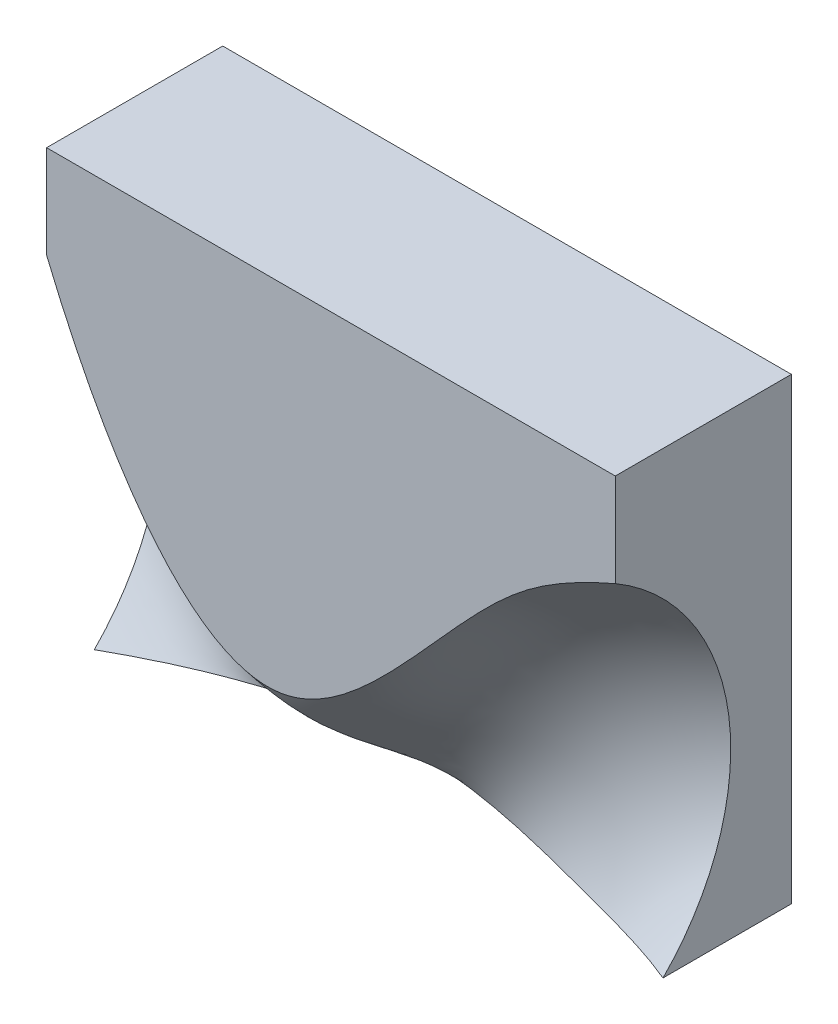
ISO-10303-21;
HEADER;
FILE_DESCRIPTION(('STEP AP214'),'2;1');
FILE_NAME('part.step','',(''),(''),'','','');
FILE_SCHEMA(('AUTOMOTIVE_DESIGN { 1 0 10303 214 1 1 1 1 }'));
ENDSEC;
DATA;
#1=APPLICATION_CONTEXT('core data for automotive mechanical design processes');
#2=APPLICATION_PROTOCOL_DEFINITION('international standard','automotive_design',2000,#1);
#3=PRODUCT_CONTEXT('',#1,'mechanical');
#4=PRODUCT('Part','Part','',(#3));
#5=PRODUCT_RELATED_PRODUCT_CATEGORY('part','',(#4));
#6=PRODUCT_DEFINITION_FORMATION('','',#4);
#7=PRODUCT_DEFINITION_CONTEXT('part definition',#1,'design');
#8=PRODUCT_DEFINITION('design','',#6,#7);
#9=PRODUCT_DEFINITION_SHAPE('','',#8);
#10=(LENGTH_UNIT() NAMED_UNIT(*) SI_UNIT(.MILLI.,.METRE.));
#11=(NAMED_UNIT(*) PLANE_ANGLE_UNIT() SI_UNIT($,.RADIAN.));
#12=(NAMED_UNIT(*) SI_UNIT($,.STERADIAN.) SOLID_ANGLE_UNIT());
#13=UNCERTAINTY_MEASURE_WITH_UNIT(LENGTH_MEASURE(1.E-05),#10,'distance_accuracy_value','');
#14=(GEOMETRIC_REPRESENTATION_CONTEXT(3) GLOBAL_UNCERTAINTY_ASSIGNED_CONTEXT((#13)) GLOBAL_UNIT_ASSIGNED_CONTEXT((#10,
#11,#12)) REPRESENTATION_CONTEXT('',''));
#15=CARTESIAN_POINT('',(0.,0.,0.));
#16=DIRECTION('',(0.,0.,1.));
#17=DIRECTION('',(1.,0.,0.));
#18=AXIS2_PLACEMENT_3D('',#15,#16,#17);
#19=CARTESIAN_POINT('',(155.,44.7708039134645,32.0313792476103));
#20=DIRECTION('',(1.,0.,0.));
#21=DIRECTION('',(0.,0.,-1.));
#22=AXIS2_PLACEMENT_3D('',#19,#20,#21);
#23=PLANE('',#22);
#24=DIRECTION('',(0.,1.,0.));
#25=VECTOR('',#24,1.);
#26=CARTESIAN_POINT('',(155.,0.,-48.));
#27=LINE('',#26,#25);
#28=CARTESIAN_POINT('',(155.,0.,-48.));
#29=VERTEX_POINT('',#28);
#30=CARTESIAN_POINT('',(155.,125.,-48.));
#31=VERTEX_POINT('',#30);
#32=EDGE_CURVE('E155',#29,#31,#27,.T.);
#33=ORIENTED_EDGE('',*,*,#32,.T.);
#34=DIRECTION('',(0.,0.,1.));
#35=VECTOR('',#34,1.);
#36=CARTESIAN_POINT('',(155.,125.,-48.));
#37=LINE('',#36,#35);
#38=CARTESIAN_POINT('',(155.,125.,0.));
#39=VERTEX_POINT('',#38);
#40=EDGE_CURVE('E242',#31,#39,#37,.T.);
#41=ORIENTED_EDGE('',*,*,#40,.T.);
#42=DIRECTION('',(0.,-1.,0.));
#43=VECTOR('',#42,1.);
#44=CARTESIAN_POINT('',(155.,125.,0.));
#45=LINE('',#44,#43);
#46=CARTESIAN_POINT('',(155.,99.6,0.));
#47=VERTEX_POINT('',#46);
#48=EDGE_CURVE('E240',#39,#47,#45,.T.);
#49=ORIENTED_EDGE('',*,*,#48,.T.);
#50=CARTESIAN_POINT('',(155.,44.7708039134645,32.0313792476103));
#51=DIRECTION('',(-1.,0.,0.));
#52=DIRECTION('',(0.,0.,-1.));
#53=AXIS2_PLACEMENT_3D('',#50,#51,#52);
#54=CIRCLE('',#53,63.5);
#55=CARTESIAN_POINT('',(155.,0.,-13.));
#56=VERTEX_POINT('',#55);
#57=EDGE_CURVE('E107',#47,#56,#54,.T.);
#58=ORIENTED_EDGE('',*,*,#57,.T.);
#59=DIRECTION('',(0.,0.,-1.));
#60=VECTOR('',#59,1.);
#61=CARTESIAN_POINT('',(155.,0.,-13.));
#62=LINE('',#61,#60);
#63=EDGE_CURVE('E13',#56,#29,#62,.T.);
#64=ORIENTED_EDGE('',*,*,#63,.T.);
#65=EDGE_LOOP('',(#33,#41,#49,#58,#64));
#66=FACE_BOUND('',#65,.T.);
#67=ADVANCED_FACE('F97',(#66),#23,.T.);
#68=CARTESIAN_POINT('',(0.,44.7708039134645,32.0313792476103));
#69=DIRECTION('',(1.,0.,0.));
#70=DIRECTION('',(0.,0.,-1.));
#71=AXIS2_PLACEMENT_3D('',#68,#69,#70);
#72=PLANE('',#71);
#73=CARTESIAN_POINT('',(0.,44.7708039134645,32.0313792476103));
#74=DIRECTION('',(-1.,0.,0.));
#75=DIRECTION('',(0.,0.,-1.));
#76=AXIS2_PLACEMENT_3D('',#73,#74,#75);
#77=CIRCLE('',#76,63.5);
#78=CARTESIAN_POINT('',(0.,99.6,0.));
#79=VERTEX_POINT('',#78);
#80=CARTESIAN_POINT('',(0.,0.,-13.));
#81=VERTEX_POINT('',#80);
#82=EDGE_CURVE('E223',#79,#81,#77,.T.);
#83=ORIENTED_EDGE('',*,*,#82,.F.);
#84=DIRECTION('',(0.,-1.,0.));
#85=VECTOR('',#84,1.);
#86=CARTESIAN_POINT('',(0.,99.6,0.));
#87=LINE('',#86,#85);
#88=CARTESIAN_POINT('',(0.,125.,0.));
#89=VERTEX_POINT('',#88);
#90=EDGE_CURVE('E216',#89,#79,#87,.T.);
#91=ORIENTED_EDGE('',*,*,#90,.F.);
#92=DIRECTION('',(0.,0.,1.));
#93=VECTOR('',#92,1.);
#94=CARTESIAN_POINT('',(0.,125.,0.));
#95=LINE('',#94,#93);
#96=CARTESIAN_POINT('',(0.,125.,-48.));
#97=VERTEX_POINT('',#96);
#98=EDGE_CURVE('E173',#97,#89,#95,.T.);
#99=ORIENTED_EDGE('',*,*,#98,.F.);
#100=DIRECTION('',(0.,1.,0.));
#101=VECTOR('',#100,1.);
#102=CARTESIAN_POINT('',(0.,125.,-48.));
#103=LINE('',#102,#101);
#104=CARTESIAN_POINT('',(0.,0.,-48.));
#105=VERTEX_POINT('',#104);
#106=EDGE_CURVE('E152',#105,#97,#103,.T.);
#107=ORIENTED_EDGE('',*,*,#106,.F.);
#108=DIRECTION('',(0.,0.,-1.));
#109=VECTOR('',#108,1.);
#110=CARTESIAN_POINT('',(0.,0.,-48.));
#111=LINE('',#110,#109);
#112=EDGE_CURVE('E160',#81,#105,#111,.T.);
#113=ORIENTED_EDGE('',*,*,#112,.F.);
#114=EDGE_LOOP('',(#83,#91,#99,#107,#113));
#115=FACE_BOUND('',#114,.T.);
#116=ADVANCED_FACE('F171',(#115),#72,.F.);
#117=CARTESIAN_POINT('',(0.,99.6,0.));
#118=CARTESIAN_POINT('',(18.4463147225643,55.0797553190255,0.));
#119=CARTESIAN_POINT('',(63.1479371753812,-4.12809199431208,0.));
#120=CARTESIAN_POINT('',(115.404515337188,79.9425296539021,0.));
#121=CARTESIAN_POINT('',(144.829157223597,95.1057896840998,0.));
#122=CARTESIAN_POINT('',(155.,99.6,0.));
#123=CARTESIAN_POINT('',(0.,98.3609811489257,-2.12087050686501));
#124=CARTESIAN_POINT('',(18.4664976210414,54.2167543326367,-1.21504740185438));
#125=CARTESIAN_POINT('',(63.1524036354619,-4.5646470743876,0.061651741691806));
#126=CARTESIAN_POINT('',(115.370254146534,78.5499694899022,-1.2592659578016));
#127=CARTESIAN_POINT('',(144.860938493674,93.8348090443819,-1.84494879154669));
#128=CARTESIAN_POINT('',(155.,98.3609811489257,-2.12087050686501));
#129=CARTESIAN_POINT('',(0.,95.6549508307603,-6.18938177909692));
#130=CARTESIAN_POINT('',(18.5068634179955,52.2627597438423,-3.47191246406506));
#131=CARTESIAN_POINT('',(63.1613365556236,-5.31133239023717,0.0341428339777198));
#132=CARTESIAN_POINT('',(115.301731765228,75.7821948276059,-3.69035702983969));
#133=CARTESIAN_POINT('',(144.924501033829,91.0648551489292,-5.36161663314196));
#134=CARTESIAN_POINT('',(155.,95.6549508307603,-6.18938177909692));
#135=CARTESIAN_POINT('',(0.,90.9695538174774,-11.7335083937412));
#136=CARTESIAN_POINT('',(18.6301534181345,49.1952116069509,-6.76764000527566));
#137=CARTESIAN_POINT('',(63.138642272238,-6.20752344616407,-0.290225843180809));
#138=CARTESIAN_POINT('',(115.220142305649,71.4657684309776,-7.01367686660776));
#139=CARTESIAN_POINT('',(145.003791524391,86.4942515737353,-10.1802253611247));
#140=CARTESIAN_POINT('',(155.,90.9695538174774,-11.7335083937412));
#141=CARTESIAN_POINT('',(0.,85.7189688801534,-16.6795819496924));
#142=CARTESIAN_POINT('',(18.7966518320037,45.881858824287,-9.83112760159955));
#143=CARTESIAN_POINT('',(63.0910755972589,-6.85627179130396,-0.945921663126462));
#144=CARTESIAN_POINT('',(115.153188478117,67.053712970156,-10.0452636347243));
#145=CARTESIAN_POINT('',(145.071990723106,81.4876326724401,-14.4950129618949));
#146=CARTESIAN_POINT('',(155.,85.7189688801534,-16.6795819496924));
#147=CARTESIAN_POINT('',(0.,79.9580691406499,-20.98901072987));
#148=CARTESIAN_POINT('',(19.0075391985815,42.3875103792098,-12.6745608491567));
#149=CARTESIAN_POINT('',(63.0176261729074,-7.28181699190851,-1.92259579200262));
#150=CARTESIAN_POINT('',(115.102115372988,62.5403645771865,-12.7910444215339));
#151=CARTESIAN_POINT('',(145.12803542904,76.1002733878092,-18.2890507047545));
#152=CARTESIAN_POINT('',(155.,79.9580691406499,-20.98901072987));
#153=CARTESIAN_POINT('',(0.,73.7533681616479,-24.6216836825481));
#154=CARTESIAN_POINT('',(19.2550233746642,38.7362381354707,-15.2692545123362));
#155=CARTESIAN_POINT('',(62.9225631817881,-7.49589507513657,-3.22539417412998));
#156=CARTESIAN_POINT('',(115.064836210733,57.9342297338487,-15.2636251088477));
#157=CARTESIAN_POINT('',(145.173428845595,70.3727511006798,-21.5374435931755));
#158=CARTESIAN_POINT('',(155.,73.7533681616479,-24.6216836825481));
#159=CARTESIAN_POINT('',(0.,67.1496650313612,-27.5403239745561));
#160=CARTESIAN_POINT('',(19.5340688073798,34.9534951781419,-17.5999064173275));
#161=CARTESIAN_POINT('',(62.8079256641425,-7.51279365984608,-4.85480286537044));
#162=CARTESIAN_POINT('',(115.041841743247,53.2487708356522,-17.4723672131441));
#163=CARTESIAN_POINT('',(145.207488176049,64.3412521960889,-24.2188561722644));
#164=CARTESIAN_POINT('',(155.,67.1496650313612,-27.5403239745561));
#165=CARTESIAN_POINT('',(0.,60.2327891732735,-29.7022994076778));
#166=CARTESIAN_POINT('',(19.8324197447298,31.0826303635871,-19.6468202602364));
#167=CARTESIAN_POINT('',(62.6807652748117,-7.34706192504421,-6.81260362830807));
#168=CARTESIAN_POINT('',(115.028988902285,48.4778589158644,-19.4282961477643));
#169=CARTESIAN_POINT('',(145.233351989731,58.0604410177421,-26.3102458475641));
#170=CARTESIAN_POINT('',(155.,60.2327891732735,-29.7022994076778));
#171=CARTESIAN_POINT('',(0.,53.0076507425958,-31.0755395355803));
#172=CARTESIAN_POINT('',(20.144850986043,27.1254636222994,-21.3968438091079));
#173=CARTESIAN_POINT('',(62.5425281387963,-7.01010327350659,-9.09937842527562));
#174=CARTESIAN_POINT('',(115.028498099343,43.6543418220271,-21.1380944441463));
#175=CARTESIAN_POINT('',(145.248772787193,51.5479361058217,-27.7927896505866));
#176=CARTESIAN_POINT('',(155.,53.0076507425958,-31.0755395355803));
#177=CARTESIAN_POINT('',(0.,45.672092232779,-31.6027919802322));
#178=CARTESIAN_POINT('',(20.4432788965397,23.1823753650142,-22.8256465984788));
#179=CARTESIAN_POINT('',(62.4120262264035,-6.51990884840113,-11.7175534306069));
#180=CARTESIAN_POINT('',(115.024096059769,38.7163201484997,-22.6163872774511));
#181=CARTESIAN_POINT('',(145.267039863834,44.911294616733,-28.6399852733103));
#182=CARTESIAN_POINT('',(155.,45.672092232779,-31.6027919802322));
#183=CARTESIAN_POINT('',(0.,38.4320232107829,-31.2886105575634));
#184=CARTESIAN_POINT('',(20.7029028493539,19.3539870186429,-23.9397479878446));
#185=CARTESIAN_POINT('',(62.3060552194046,-5.89476855310294,-14.6663648776522));
#186=CARTESIAN_POINT('',(115.000944667747,33.6023850006233,-23.8510255886163));
#187=CARTESIAN_POINT('',(145.300309173521,38.257644109683,-28.850889528224));
#188=CARTESIAN_POINT('',(155.,38.4320232107829,-31.2886105575634));
#189=CARTESIAN_POINT('',(0.,31.3004209053273,-30.1627310152004));
#190=CARTESIAN_POINT('',(20.9165327822861,15.6413046023886,-24.7558139049714));
#191=CARTESIAN_POINT('',(62.2278437023826,-5.14547909627311,-17.9436631896897));
#192=CARTESIAN_POINT('',(114.958934369273,28.344755482004,-24.8219143507208));
#193=CARTESIAN_POINT('',(145.348334521774,31.6051295779082,-28.4321920942408));
#194=CARTESIAN_POINT('',(155.,31.3004209053273,-30.1627310152004));
#195=CARTESIAN_POINT('',(0.,24.3711818134048,-28.2443273488879));
#196=CARTESIAN_POINT('',(21.0690663023176,12.0856539004604,-25.2848639086261));
#197=CARTESIAN_POINT('',(62.1862698685296,-4.28605351190423,-21.5477862763232));
#198=CARTESIAN_POINT('',(114.892477761032,22.9382230247758,-25.5141051724523));
#199=CARTESIAN_POINT('',(145.415416993732,25.0074905873629,-27.3856831894418));
#200=CARTESIAN_POINT('',(155.,24.3711818134048,-28.2443273488879));
#201=CARTESIAN_POINT('',(0.,17.6971720967382,-25.5579289194153));
#202=CARTESIAN_POINT('',(21.1495474548204,8.70922940144126,-25.5350669118764));
#203=CARTESIAN_POINT('',(62.1867360223851,-3.32897618144512,-25.4784255926592));
#204=CARTESIAN_POINT('',(114.800174546516,17.3953315976007,-25.9124184074712));
#205=CARTESIAN_POINT('',(145.502290700517,18.5015832999094,-25.7132243435808));
#206=CARTESIAN_POINT('',(155.,17.6971720967382,-25.5579289194153));
#207=CARTESIAN_POINT('',(0.,11.352972391517,-22.1252308690171));
#208=CARTESIAN_POINT('',(21.1424132918595,5.53851793405746,-25.524066254818));
#209=CARTESIAN_POINT('',(62.2361865945747,-2.28808233479409,-29.7306504130613));
#210=CARTESIAN_POINT('',(114.68189967969,11.7272174008486,-26.0027586346634));
#211=CARTESIAN_POINT('',(145.608321946345,12.1257357814289,-23.416156210243));
#212=CARTESIAN_POINT('',(155.,11.352972391517,-22.1252308690171));
#213=CARTESIAN_POINT('',(0.,5.40152289311241,-17.9694476745731));
#214=CARTESIAN_POINT('',(21.046921173731,2.621200461613,-25.2196232638645));
#215=CARTESIAN_POINT('',(62.3332067020537,-1.17578179273334,-34.3199640336552));
#216=CARTESIAN_POINT('',(114.542109072382,5.91738083540859,-25.7752904368487));
#217=CARTESIAN_POINT('',(145.729467596306,5.94414714939489,-20.4895965362154));
#218=CARTESIAN_POINT('',(155.,5.40152289311242,-17.9694476745731));
#219=CARTESIAN_POINT('',(0.,1.74187715572148,-14.7317977348937));
#220=CARTESIAN_POINT('',(20.8910489094842,0.815103011888346,-24.9182636910272));
#221=CARTESIAN_POINT('',(62.4431843425945,-0.397793523795577,-37.5667434371804));
#222=CARTESIAN_POINT('',(114.437566543697,2.01614240489604,-25.3930065527386));
#223=CARTESIAN_POINT('',(145.816017155376,1.92275190781566,-18.1323136424423));
#224=CARTESIAN_POINT('',(155.,1.74187715572148,-14.7317977348937));
#225=CARTESIAN_POINT('',(0.,0.,-13.));
#226=CARTESIAN_POINT('',(20.8131127773609,0.,-24.6546111395546));
#227=CARTESIAN_POINT('',(62.4981731628649,0.,-39.2734209963057));
#228=CARTESIAN_POINT('',(114.385295279354,0.,-25.14992518824));
#229=CARTESIAN_POINT('',(145.859291934911,0.,-16.8406994305017));
#230=CARTESIAN_POINT('',(155.,0.,-13.));
#231=B_SPLINE_SURFACE_WITH_KNOTS('',3,3,((#117,#118,#119,#120,#121,#122),(#123,#124,#125,#126,
#127,#128),(#129,#130,#131,#132,#133,#134),(#135,#136,#137,#138,#139,#140),(#141,#142,#143,#144,
#145,#146),(#147,#148,#149,#150,#151,#152),(#153,#154,#155,#156,#157,#158),(#159,#160,#161,#162,
#163,#164),(#165,#166,#167,#168,#169,#170),(#171,#172,#173,#174,#175,#176),(#177,#178,#179,#180,
#181,#182),(#183,#184,#185,#186,#187,#188),(#189,#190,#191,#192,#193,#194),(#195,#196,#197,#198,
#199,#200),(#201,#202,#203,#204,#205,#206),(#207,#208,#209,#210,#211,#212),(#213,#214,#215,#216,
#217,#218),(#219,#220,#221,#222,#223,#224),(#225,#226,#227,#228,#229,#230)),.UNSPECIFIED.,.F.,
.F.,.F.,(4,1,1,1,1,1,1,1,1,1,1,1,1,1,1,1,4),(4,1,1,4),(0.,0.0625,0.125,0.1875,0.25,0.3125,0.375,
0.4375,0.5,0.5625,0.625,0.6875,0.75,0.8125,0.875,0.9375,1.),(0.,0.419525087310185,
0.824952913607741,1.),.UNSPECIFIED.);
#232=CARTESIAN_POINT('',(0.,0.,-13.));
#233=CARTESIAN_POINT('',(20.8131127773609,0.,-24.6546111395546));
#234=CARTESIAN_POINT('',(62.4981731628649,0.,-39.2734209963057));
#235=CARTESIAN_POINT('',(114.385295279354,0.,-25.14992518824));
#236=CARTESIAN_POINT('',(145.859291934911,0.,-16.8406994305017));
#237=CARTESIAN_POINT('',(155.,0.,-13.));
#238=B_SPLINE_CURVE_WITH_KNOTS('',3,(#232,#233,#234,#235,#236,#237),.UNSPECIFIED.,.F.,.F.,(4,1,
1,4),(0.,0.419525087310185,0.824952913607741,1.),.UNSPECIFIED.);
#239=EDGE_CURVE('E122',#81,#56,#238,.T.);
#240=CARTESIAN_POINT('',(0.,99.6,0.));
#241=CARTESIAN_POINT('',(18.4463147225643,55.0797553190255,0.));
#242=CARTESIAN_POINT('',(63.1479371753812,-4.12809199431208,0.));
#243=CARTESIAN_POINT('',(115.404515337188,79.9425296539021,0.));
#244=CARTESIAN_POINT('',(144.829157223597,95.1057896840998,0.));
#245=CARTESIAN_POINT('',(155.,99.6,0.));
#246=B_SPLINE_CURVE_WITH_KNOTS('',3,(#240,#241,#242,#243,#244,#245),.UNSPECIFIED.,.F.,.F.,(4,1,
1,4),(0.,0.419525087310185,0.824952913607741,1.),.UNSPECIFIED.);
#247=EDGE_CURVE('E166',#47,#79,#246,.F.);
#248=CARTESIAN_POINT('',(-5.80397601247188E-05,99.6001400791627,0.));
#249=CARTESIAN_POINT('',(-3.86931734164792E-05,99.6000933861085,0.));
#250=CARTESIAN_POINT('',(-1.93465867082396E-05,99.6000466930542,0.));
#251=CARTESIAN_POINT('',(0.,99.6,0.));
#252=CARTESIAN_POINT('',(18.4463147225643,55.0797553190255,0.));
#253=CARTESIAN_POINT('',(63.1479371753812,-4.12809199431208,0.));
#254=CARTESIAN_POINT('',(115.404515337188,79.9425296539021,0.));
#255=CARTESIAN_POINT('',(144.829157223597,95.1057896840998,0.));
#256=CARTESIAN_POINT('',(155.,99.6,0.));
#257=CARTESIAN_POINT('',(-5.81032638979032E-05,98.3611200449802,-2.12087335696035));
#258=CARTESIAN_POINT('',(-3.87355092652688E-05,98.3610737462954,-2.12087240692857));
#259=CARTESIAN_POINT('',(-1.93677546326344E-05,98.3610274476106,-2.12087145689679));
#260=CARTESIAN_POINT('',(0.,98.3609811489257,-2.12087050686501));
#261=CARTESIAN_POINT('',(18.4664976210414,54.2167543326367,-1.21504740185438));
#262=CARTESIAN_POINT('',(63.1524036354619,-4.5646470743876,0.061651741691806));
#263=CARTESIAN_POINT('',(115.370254146534,78.5499694899022,-1.2592659578016));
#264=CARTESIAN_POINT('',(144.860938493674,93.8348090443819,-1.84494879154669));
#265=CARTESIAN_POINT('',(155.,98.3609811489257,-2.12087050686501));
#266=CARTESIAN_POINT('',(-5.82302714442722E-05,95.6550873605983,-6.18939032938295));
#267=CARTESIAN_POINT('',(-3.88201809628482E-05,95.6550418506523,-6.18938747928761));
#268=CARTESIAN_POINT('',(-1.94100904814241E-05,95.6549963407063,-6.18938462919226));
#269=CARTESIAN_POINT('',(0.,95.6549508307603,-6.18938177909692));
#270=CARTESIAN_POINT('',(18.5068634179955,52.2627597438423,-3.47191246406506));
#271=CARTESIAN_POINT('',(63.1613365556236,-5.31133239023717,0.0341428339777198));
#272=CARTESIAN_POINT('',(115.301731765228,75.7821948276059,-3.69035702983969));
#273=CARTESIAN_POINT('',(144.924501033829,91.0648551489292,-5.36161663314196));
#274=CARTESIAN_POINT('',(155.,95.6549508307603,-6.18938177909692));
#275=CARTESIAN_POINT('',(-5.86181929419515E-05,90.9696852568916,-11.7335240184236));
#276=CARTESIAN_POINT('',(-3.90787952946343E-05,90.9696414437535,-11.7335188101961));
#277=CARTESIAN_POINT('',(-1.95393976473172E-05,90.9695976306154,-11.7335136019686));
#278=CARTESIAN_POINT('',(0.,90.9695538174774,-11.7335083937412));
#279=CARTESIAN_POINT('',(18.6301534181345,49.1952116069509,-6.76764000527566));
#280=CARTESIAN_POINT('',(63.138642272238,-6.20752344616407,-0.290225843180809));
#281=CARTESIAN_POINT('',(115.220142305649,71.4657684309776,-7.01367686660776));
#282=CARTESIAN_POINT('',(145.003791524391,86.4942515737353,-10.1802253611247));
#283=CARTESIAN_POINT('',(155.,90.9695538174774,-11.7335083937412));
#284=CARTESIAN_POINT('',(-5.91420660378766E-05,85.7190942242315,-16.6796034977714));
#285=CARTESIAN_POINT('',(-3.94280440252511E-05,85.7190524428721,-16.6795963150784));
#286=CARTESIAN_POINT('',(-1.97140220126255E-05,85.7190106615128,-16.6795891323854));
#287=CARTESIAN_POINT('',(0.,85.7189688801534,-16.6795819496924));
#288=CARTESIAN_POINT('',(18.7966518320037,45.881858824287,-9.83112760159955));
#289=CARTESIAN_POINT('',(63.0910755972589,-6.85627179130396,-0.945921663126462));
#290=CARTESIAN_POINT('',(115.153188478117,67.053712970156,-10.0452636347243));
#291=CARTESIAN_POINT('',(145.071990723106,81.4876326724401,-14.4950129618949));
#292=CARTESIAN_POINT('',(155.,85.7189688801534,-16.6795819496924));
#293=CARTESIAN_POINT('',(-5.98056051975187E-05,79.9581873532171,-20.9890368905792));
#294=CARTESIAN_POINT('',(-3.98704034650125E-05,79.958147949028,-20.9890281703428));
#295=CARTESIAN_POINT('',(-1.99352017325062E-05,79.958108544839,-20.9890194501064));
#296=CARTESIAN_POINT('',(0.,79.9580691406499,-20.98901072987));
#297=CARTESIAN_POINT('',(19.0075391985815,42.3875103792098,-12.6745608491567));
#298=CARTESIAN_POINT('',(63.0176261729074,-7.28181699190851,-1.92259579200262));
#299=CARTESIAN_POINT('',(115.102115372988,62.5403645771865,-12.7910444215339));
#300=CARTESIAN_POINT('',(145.12803542904,76.1002733878092,-18.2890507047545));
#301=CARTESIAN_POINT('',(155.,79.9580691406499,-20.98901072987));
#302=CARTESIAN_POINT('',(-6.05842931051329E-05,73.7534783400687,-24.6217131091709));
#303=CARTESIAN_POINT('',(-4.03895287367552E-05,73.7534416139284,-24.6217033002966));
#304=CARTESIAN_POINT('',(-2.01947643683776E-05,73.7534048877882,-24.6216934914224));
#305=CARTESIAN_POINT('',(0.,73.7533681616479,-24.6216836825481));
#306=CARTESIAN_POINT('',(19.2550233746642,38.7362381354707,-15.2692545123362));
#307=CARTESIAN_POINT('',(62.9225631817881,-7.49589507513657,-3.22539417412998));
#308=CARTESIAN_POINT('',(115.064836210733,57.9342297338487,-15.2636251088477));
#309=CARTESIAN_POINT('',(145.173428845595,70.3727511006798,-21.5374435931755));
#310=CARTESIAN_POINT('',(155.,73.7533681616479,-24.6216836825481));
#311=CARTESIAN_POINT('',(-6.14622858219599E-05,67.1497663338708,-27.5403552512344));
#312=CARTESIAN_POINT('',(-4.097485721464E-05,67.1497325663676,-27.540344825675));
#313=CARTESIAN_POINT('',(-2.048742860732E-05,67.1496987988644,-27.5403344001156));
#314=CARTESIAN_POINT('',(0.,67.1496650313612,-27.5403239745561));
#315=CARTESIAN_POINT('',(19.5340688073798,34.9534951781419,-17.5999064173275));
#316=CARTESIAN_POINT('',(62.8079256641425,-7.51279365984608,-4.85480286537044));
#317=CARTESIAN_POINT('',(115.041841743247,53.2487708356522,-17.4723672131441));
#318=CARTESIAN_POINT('',(145.207488176049,64.3412521960889,-24.2188561722644));
#319=CARTESIAN_POINT('',(155.,67.1496650313612,-27.5403239745561));
#320=CARTESIAN_POINT('',(-6.24010216668818E-05,60.2328808917685,-29.7023310463875));
#321=CARTESIAN_POINT('',(-4.16006811112545E-05,60.2328503189368,-29.7023205001509));
#322=CARTESIAN_POINT('',(-2.08003405556273E-05,60.2328197461051,-29.7023099539144));
#323=CARTESIAN_POINT('',(0.,60.2327891732735,-29.7022994076778));
#324=CARTESIAN_POINT('',(19.8324197447298,31.0826303635871,-19.6468202602364));
#325=CARTESIAN_POINT('',(62.6807652748117,-7.34706192504421,-6.81260362830807));
#326=CARTESIAN_POINT('',(115.028988902285,48.4778589158644,-19.4282961477643));
#327=CARTESIAN_POINT('',(145.233351989731,58.0604410177421,-26.3102458475641));
#328=CARTESIAN_POINT('',(155.,60.2327891732735,-29.7022994076778));
#329=CARTESIAN_POINT('',(-6.33840599904718E-05,53.0077321786959,-31.0755699887731));
#330=CARTESIAN_POINT('',(-4.22560399936479E-05,53.0077050333292,-31.0755598377089));
#331=CARTESIAN_POINT('',(-2.11280199968239E-05,53.0076778879625,-31.0755496866446));
#332=CARTESIAN_POINT('',(0.,53.0076507425958,-31.0755395355803));
#333=CARTESIAN_POINT('',(20.144850986043,27.1254636222994,-21.3968438091079));
#334=CARTESIAN_POINT('',(62.5425281387963,-7.01010327350659,-9.09937842527562));
#335=CARTESIAN_POINT('',(115.028498099343,43.6543418220271,-21.1380944441463));
#336=CARTESIAN_POINT('',(145.248772787193,51.5479361058217,-27.7927896505866));
#337=CARTESIAN_POINT('',(155.,53.0076507425958,-31.0755395355803));
#338=CARTESIAN_POINT('',(-6.43230380248519E-05,45.67216299476,-31.6028195967735));
#339=CARTESIAN_POINT('',(-4.28820253499012E-05,45.672139407433,-31.6028103912598));
#340=CARTESIAN_POINT('',(-2.14410126749506E-05,45.672115820106,-31.602801185746));
#341=CARTESIAN_POINT('',(0.,45.672092232779,-31.6027919802322));
#342=CARTESIAN_POINT('',(20.4432788965397,23.1823753650142,-22.8256465984788));
#343=CARTESIAN_POINT('',(62.4120262264035,-6.51990884840113,-11.7175534306069));
#344=CARTESIAN_POINT('',(115.024096059769,38.7163201484997,-22.6163872774511));
#345=CARTESIAN_POINT('',(145.267039863834,44.911294616733,-28.6399852733103));
#346=CARTESIAN_POINT('',(155.,45.672092232779,-31.6027919802322));
#347=CARTESIAN_POINT('',(-6.51399227072724E-05,38.4320832382009,-31.2886336801343));
#348=CARTESIAN_POINT('',(-4.34266151381816E-05,38.4320632290616,-31.2886259726107));
#349=CARTESIAN_POINT('',(-2.17133075690908E-05,38.4320432199222,-31.288618265087));
#350=CARTESIAN_POINT('',(0.,38.4320232107829,-31.2886105575634));
#351=CARTESIAN_POINT('',(20.7029028493539,19.3539870186429,-23.9397479878446));
#352=CARTESIAN_POINT('',(62.3060552194046,-5.89476855310294,-14.6663648776522));
#353=CARTESIAN_POINT('',(115.000944667747,33.6023850006233,-23.8510255886163));
#354=CARTESIAN_POINT('',(145.300309173521,38.257644109683,-28.850889528224));
#355=CARTESIAN_POINT('',(155.,38.4320232107829,-31.2886105575634));
#356=CARTESIAN_POINT('',(-6.58120911186503E-05,31.3004701754047,-30.1627480276052));
#357=CARTESIAN_POINT('',(-4.38747274124335E-05,31.3004537520456,-30.1627423568036));
#358=CARTESIAN_POINT('',(-2.19373637062168E-05,31.3004373286864,-30.162736686002));
#359=CARTESIAN_POINT('',(0.,31.3004209053273,-30.1627310152004));
#360=CARTESIAN_POINT('',(20.9165327822861,15.6413046023886,-24.7558139049714));
#361=CARTESIAN_POINT('',(62.2278437023826,-5.14547909627311,-17.9436631896897));
#362=CARTESIAN_POINT('',(114.958934369273,28.344755482004,-24.8219143507208));
#363=CARTESIAN_POINT('',(145.348334521774,31.6051295779082,-28.4321920942408));
#364=CARTESIAN_POINT('',(155.,31.3004209053273,-30.1627310152004));
#365=CARTESIAN_POINT('',(-6.62920248640493E-05,24.3712204687733,-28.2443366605879));
#366=CARTESIAN_POINT('',(-4.41946832426995E-05,24.3712075836505,-28.2443335566879));
#367=CARTESIAN_POINT('',(-2.20973416213498E-05,24.3711946985277,-28.2443304527879));
#368=CARTESIAN_POINT('',(0.,24.3711818134048,-28.2443273488879));
#369=CARTESIAN_POINT('',(21.0690663023176,12.0856539004604,-25.2848639086261));
#370=CARTESIAN_POINT('',(62.1862698685296,-4.28605351190423,-21.5477862763232));
#371=CARTESIAN_POINT('',(114.892477761032,22.9382230247758,-25.5141051724523));
#372=CARTESIAN_POINT('',(145.415416993732,25.0074905873629,-27.3856831894418));
#373=CARTESIAN_POINT('',(155.,24.3711818134048,-28.2443273488879));
#374=CARTESIAN_POINT('',(-6.65452519642088E-05,17.6972003765354,-25.5579289913487));
#375=CARTESIAN_POINT('',(-4.43635013094725E-05,17.6971909499363,-25.5579289673709));
#376=CARTESIAN_POINT('',(-2.21817506547363E-05,17.6971815233373,-25.5579289433931));
#377=CARTESIAN_POINT('',(0.,17.6971720967382,-25.5579289194153));
#378=CARTESIAN_POINT('',(21.1495474548204,8.70922940144126,-25.5350669118764));
#379=CARTESIAN_POINT('',(62.1867360223851,-3.32897618144512,-25.4784255926592));
#380=CARTESIAN_POINT('',(114.800174546516,17.3953315976007,-25.9124184074712));
#381=CARTESIAN_POINT('',(145.502290700517,18.5015832999094,-25.7132243435808));
#382=CARTESIAN_POINT('',(155.,17.6971720967382,-25.5579289194153));
#383=CARTESIAN_POINT('',(-6.65228049273251E-05,11.3529906862033,-22.1252201748707));
#384=CARTESIAN_POINT('',(-4.43485366182167E-05,11.3529845879745,-22.1252237395862));
#385=CARTESIAN_POINT('',(-2.21742683091084E-05,11.3529784897458,-22.1252273043017));
#386=CARTESIAN_POINT('',(0.,11.352972391517,-22.1252308690171));
#387=CARTESIAN_POINT('',(21.1424132918595,5.53851793405746,-25.524066254818));
#388=CARTESIAN_POINT('',(62.2361865945747,-2.28808233479409,-29.7306504130613));
#389=CARTESIAN_POINT('',(114.68189967969,11.7272174008486,-26.0027586346634));
#390=CARTESIAN_POINT('',(145.608321946345,12.1257357814289,-23.416156210243));
#391=CARTESIAN_POINT('',(155.,11.352972391517,-22.1252308690171));
#392=CARTESIAN_POINT('',(-6.62223471007437E-05,5.40153164116044,-17.9694248625123));
#393=CARTESIAN_POINT('',(-4.41482314004958E-05,5.40152872514443,-17.9694324665326));
#394=CARTESIAN_POINT('',(-2.20741157002479E-05,5.40152580912842,-17.9694400705528));
#395=CARTESIAN_POINT('',(0.,5.40152289311241,-17.9694476745731));
#396=CARTESIAN_POINT('',(21.046921173731,2.621200461613,-25.2196232638645));
#397=CARTESIAN_POINT('',(62.3332067020537,-1.17578179273334,-34.3199640336552));
#398=CARTESIAN_POINT('',(114.542109072382,5.91738083540859,-25.7752904368487));
#399=CARTESIAN_POINT('',(145.729467596306,5.94414714939489,-20.4895965362154));
#400=CARTESIAN_POINT('',(155.,5.40152289311242,-17.9694476745731));
#401=CARTESIAN_POINT('',(-6.57319082806844E-05,1.74188007173749,-14.7317656840451));
#402=CARTESIAN_POINT('',(-4.38212721871229E-05,1.74187909973215,-14.7317763676613));
#403=CARTESIAN_POINT('',(-2.19106360935615E-05,1.74187812772682,-14.7317870512775));
#404=CARTESIAN_POINT('',(0.,1.74187715572148,-14.7317977348937));
#405=CARTESIAN_POINT('',(20.8910489094842,0.815103011888346,-24.9182636910272));
#406=CARTESIAN_POINT('',(62.4431843425945,-0.397793523795577,-37.5667434371804));
#407=CARTESIAN_POINT('',(114.437566543697,2.01614240489604,-25.3930065527386));
#408=CARTESIAN_POINT('',(145.816017155376,1.92275190781566,-18.1323136424423));
#409=CARTESIAN_POINT('',(155.,1.74187715572148,-14.7317977348937));
#410=CARTESIAN_POINT('',(-6.54866888706547E-05,0.,-12.9999633297575));
#411=CARTESIAN_POINT('',(-4.36577925804365E-05,0.,-12.9999755531717));
#412=CARTESIAN_POINT('',(-2.18288962902182E-05,0.,-12.9999877765858));
#413=CARTESIAN_POINT('',(0.,0.,-13.));
#414=CARTESIAN_POINT('',(20.8131127773609,0.,-24.6546111395546));
#415=CARTESIAN_POINT('',(62.4981731628649,0.,-39.2734209963057));
#416=CARTESIAN_POINT('',(114.385295279354,0.,-25.14992518824));
#417=CARTESIAN_POINT('',(145.859291934911,0.,-16.8406994305017));
#418=CARTESIAN_POINT('',(155.,0.,-13.));
#419=B_SPLINE_SURFACE_WITH_KNOTS('',3,3,((#248,#249,#250,#251,#252,#253,#254,#255,#256),(#257,
#258,#259,#260,#261,#262,#263,#264,#265),(#266,#267,#268,#269,#270,#271,#272,#273,#274),(#275,
#276,#277,#278,#279,#280,#281,#282,#283),(#284,#285,#286,#287,#288,#289,#290,#291,#292),(#293,
#294,#295,#296,#297,#298,#299,#300,#301),(#302,#303,#304,#305,#306,#307,#308,#309,#310),(#311,
#312,#313,#314,#315,#316,#317,#318,#319),(#320,#321,#322,#323,#324,#325,#326,#327,#328),(#329,
#330,#331,#332,#333,#334,#335,#336,#337),(#338,#339,#340,#341,#342,#343,#344,#345,#346),(#347,
#348,#349,#350,#351,#352,#353,#354,#355),(#356,#357,#358,#359,#360,#361,#362,#363,#364),(#365,
#366,#367,#368,#369,#370,#371,#372,#373),(#374,#375,#376,#377,#378,#379,#380,#381,#382),(#383,
#384,#385,#386,#387,#388,#389,#390,#391),(#392,#393,#394,#395,#396,#397,#398,#399,#400),(#401,
#402,#403,#404,#405,#406,#407,#408,#409),(#410,#411,#412,#413,#414,#415,#416,#417,#418)),
.UNSPECIFIED.,.F.,.F.,.F.,(4,1,1,1,1,1,1,1,1,1,1,1,1,1,1,1,4),(4,3,1,1,4),(0.,0.0625,0.125,
0.1875,0.25,0.3125,0.375,0.4375,0.5,0.5625,0.625,0.6875,0.75,0.8125,0.875,0.9375,1.),(-4.4E-07,
0.,0.419525087310185,0.824952913607741,1.),.UNSPECIFIED.);
#420=ORIENTED_EDGE('',*,*,#82,.T.);
#421=ORIENTED_EDGE('',*,*,#239,.T.);
#422=ORIENTED_EDGE('',*,*,#57,.F.);
#423=ORIENTED_EDGE('',*,*,#247,.T.);
#424=EDGE_LOOP('',(#420,#421,#422,#423));
#425=FACE_BOUND('',#424,.T.);
#426=ADVANCED_FACE('F192',(#425),#419,.T.);
#427=CARTESIAN_POINT('',(0.,0.,-13.));
#428=DIRECTION('',(0.,-1.,0.));
#429=DIRECTION('',(0.,0.,-1.));
#430=AXIS2_PLACEMENT_3D('',#427,#428,#429);
#431=PLANE('',#430);
#432=ORIENTED_EDGE('',*,*,#112,.T.);
#433=DIRECTION('',(1.,0.,0.));
#434=VECTOR('',#433,1.);
#435=CARTESIAN_POINT('',(75.8973132648566,0.,-48.));
#436=LINE('',#435,#434);
#437=EDGE_CURVE('E147',#105,#29,#436,.T.);
#438=ORIENTED_EDGE('',*,*,#437,.T.);
#439=ORIENTED_EDGE('',*,*,#63,.F.);
#440=ORIENTED_EDGE('',*,*,#239,.F.);
#441=EDGE_LOOP('',(#432,#438,#439,#440));
#442=FACE_BOUND('',#441,.T.);
#443=ADVANCED_FACE('F162',(#442),#431,.T.);
#444=CARTESIAN_POINT('',(0.,125.,0.));
#445=DIRECTION('',(0.,0.,1.));
#446=DIRECTION('',(0.,-1.,0.));
#447=AXIS2_PLACEMENT_3D('',#444,#445,#446);
#448=PLANE('',#447);
#449=ORIENTED_EDGE('',*,*,#90,.T.);
#450=ORIENTED_EDGE('',*,*,#247,.F.);
#451=ORIENTED_EDGE('',*,*,#48,.F.);
#452=DIRECTION('',(1.,0.,0.));
#453=VECTOR('',#452,1.);
#454=CARTESIAN_POINT('',(75.8973132648566,125.,0.));
#455=LINE('',#454,#453);
#456=EDGE_CURVE('E252',#89,#39,#455,.T.);
#457=ORIENTED_EDGE('',*,*,#456,.F.);
#458=EDGE_LOOP('',(#449,#450,#451,#457));
#459=FACE_BOUND('',#458,.T.);
#460=ADVANCED_FACE('F286',(#459),#448,.T.);
#461=CARTESIAN_POINT('',(0.,0.,-48.));
#462=DIRECTION('',(0.,0.,-1.));
#463=DIRECTION('',(0.,1.,0.));
#464=AXIS2_PLACEMENT_3D('',#461,#462,#463);
#465=PLANE('',#464);
#466=ORIENTED_EDGE('',*,*,#106,.T.);
#467=DIRECTION('',(1.,0.,0.));
#468=VECTOR('',#467,1.);
#469=CARTESIAN_POINT('',(75.8973132648566,125.,-48.));
#470=LINE('',#469,#468);
#471=EDGE_CURVE('E158',#97,#31,#470,.T.);
#472=ORIENTED_EDGE('',*,*,#471,.T.);
#473=ORIENTED_EDGE('',*,*,#32,.F.);
#474=ORIENTED_EDGE('',*,*,#437,.F.);
#475=EDGE_LOOP('',(#466,#472,#473,#474));
#476=FACE_BOUND('',#475,.T.);
#477=ADVANCED_FACE('F149',(#476),#465,.T.);
#478=CARTESIAN_POINT('',(0.,125.,-48.));
#479=DIRECTION('',(0.,1.,0.));
#480=DIRECTION('',(0.,0.,1.));
#481=AXIS2_PLACEMENT_3D('',#478,#479,#480);
#482=PLANE('',#481);
#483=ORIENTED_EDGE('',*,*,#98,.T.);
#484=ORIENTED_EDGE('',*,*,#456,.T.);
#485=ORIENTED_EDGE('',*,*,#40,.F.);
#486=ORIENTED_EDGE('',*,*,#471,.F.);
#487=EDGE_LOOP('',(#483,#484,#485,#486));
#488=FACE_BOUND('',#487,.T.);
#489=ADVANCED_FACE('F358',(#488),#482,.T.);
#490=CLOSED_SHELL('',(#67,#116,#426,#443,#460,#477,#489));
#491=MANIFOLD_SOLID_BREP('B2',#490);
#492=ADVANCED_BREP_SHAPE_REPRESENTATION('',(#18,#491),#14);
#493=SHAPE_DEFINITION_REPRESENTATION(#9,#492);
ENDSEC;
END-ISO-10303-21;
